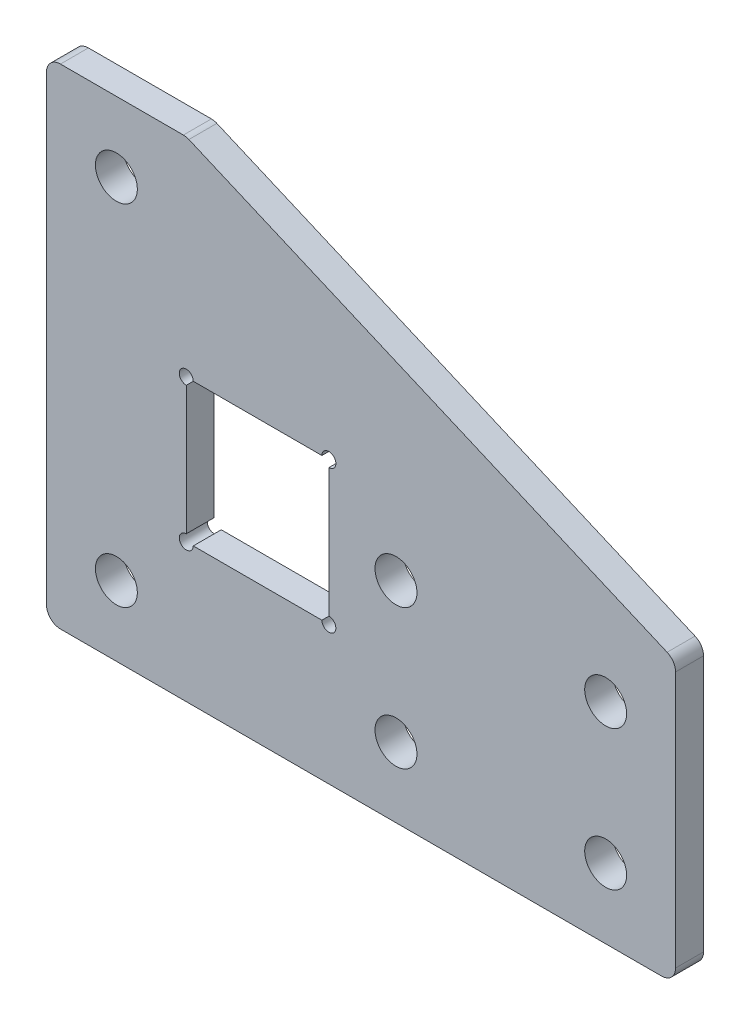
ISO-10303-21;
HEADER;
FILE_DESCRIPTION(('STEP AP214'),'2;1');
FILE_NAME('part.step','',(''),(''),'','','');
FILE_SCHEMA(('AUTOMOTIVE_DESIGN { 1 0 10303 214 1 1 1 1 }'));
ENDSEC;
DATA;
#1=APPLICATION_CONTEXT('core data for automotive mechanical design processes');
#2=APPLICATION_PROTOCOL_DEFINITION('international standard','automotive_design',2000,#1);
#3=PRODUCT_CONTEXT('',#1,'mechanical');
#4=PRODUCT('Part','Part','',(#3));
#5=PRODUCT_RELATED_PRODUCT_CATEGORY('part','',(#4));
#6=PRODUCT_DEFINITION_FORMATION('','',#4);
#7=PRODUCT_DEFINITION_CONTEXT('part definition',#1,'design');
#8=PRODUCT_DEFINITION('design','',#6,#7);
#9=PRODUCT_DEFINITION_SHAPE('','',#8);
#10=(LENGTH_UNIT() NAMED_UNIT(*) SI_UNIT(.MILLI.,.METRE.));
#11=(NAMED_UNIT(*) PLANE_ANGLE_UNIT() SI_UNIT($,.RADIAN.));
#12=(NAMED_UNIT(*) SI_UNIT($,.STERADIAN.) SOLID_ANGLE_UNIT());
#13=UNCERTAINTY_MEASURE_WITH_UNIT(LENGTH_MEASURE(1.E-05),#10,'distance_accuracy_value','');
#14=(GEOMETRIC_REPRESENTATION_CONTEXT(3) GLOBAL_UNCERTAINTY_ASSIGNED_CONTEXT((#13)) GLOBAL_UNIT_ASSIGNED_CONTEXT((#10,
#11,#12)) REPRESENTATION_CONTEXT('',''));
#15=CARTESIAN_POINT('',(0.,0.,0.));
#16=DIRECTION('',(0.,0.,1.));
#17=DIRECTION('',(1.,0.,0.));
#18=AXIS2_PLACEMENT_3D('',#15,#16,#17);
#19=CARTESIAN_POINT('',(0.,0.,2.));
#20=DIRECTION('',(0.,0.,-1.));
#21=DIRECTION('',(-1.,0.,0.));
#22=AXIS2_PLACEMENT_3D('',#19,#20,#21);
#23=PLANE('',#22);
#24=CARTESIAN_POINT('',(20.,10.,2.));
#25=DIRECTION('',(0.,0.,1.));
#26=DIRECTION('',(1.,0.,0.));
#27=AXIS2_PLACEMENT_3D('',#24,#25,#26);
#28=CIRCLE('',#27,1.50000000000003);
#29=CARTESIAN_POINT('',(21.5,10.,2.));
#30=VERTEX_POINT('',#29);
#31=EDGE_CURVE('E216',#30,#30,#28,.T.);
#32=ORIENTED_EDGE('',*,*,#31,.F.);
#33=EDGE_LOOP('',(#32));
#34=FACE_BOUND('',#33,.T.);
#35=CARTESIAN_POINT('',(35.,10.,2.));
#36=DIRECTION('',(0.,0.,1.));
#37=DIRECTION('',(1.,0.,0.));
#38=AXIS2_PLACEMENT_3D('',#35,#36,#37);
#39=CIRCLE('',#38,1.50000000000003);
#40=CARTESIAN_POINT('',(36.5,10.,2.));
#41=VERTEX_POINT('',#40);
#42=EDGE_CURVE('E222',#41,#41,#39,.T.);
#43=ORIENTED_EDGE('',*,*,#42,.F.);
#44=EDGE_LOOP('',(#43));
#45=FACE_BOUND('',#44,.T.);
#46=CARTESIAN_POINT('',(0.,25.,2.));
#47=DIRECTION('',(0.,0.,1.));
#48=DIRECTION('',(1.,0.,0.));
#49=AXIS2_PLACEMENT_3D('',#46,#47,#48);
#50=CIRCLE('',#49,1.50000000000003);
#51=CARTESIAN_POINT('',(1.50000000000003,25.,2.));
#52=VERTEX_POINT('',#51);
#53=EDGE_CURVE('E228',#52,#52,#50,.T.);
#54=ORIENTED_EDGE('',*,*,#53,.F.);
#55=EDGE_LOOP('',(#54));
#56=FACE_BOUND('',#55,.T.);
#57=CARTESIAN_POINT('',(20.,0.,2.));
#58=DIRECTION('',(0.,0.,1.));
#59=DIRECTION('',(1.,0.,0.));
#60=AXIS2_PLACEMENT_3D('',#57,#58,#59);
#61=CIRCLE('',#60,1.50000000000003);
#62=CARTESIAN_POINT('',(21.5,0.,2.));
#63=VERTEX_POINT('',#62);
#64=EDGE_CURVE('E234',#63,#63,#61,.T.);
#65=ORIENTED_EDGE('',*,*,#64,.F.);
#66=EDGE_LOOP('',(#65));
#67=FACE_BOUND('',#66,.T.);
#68=CARTESIAN_POINT('',(0.,0.,2.));
#69=DIRECTION('',(0.,0.,1.));
#70=DIRECTION('',(1.,0.,0.));
#71=AXIS2_PLACEMENT_3D('',#68,#69,#70);
#72=CIRCLE('',#71,1.50000000000002);
#73=CARTESIAN_POINT('',(1.50000000000002,0.,2.));
#74=VERTEX_POINT('',#73);
#75=EDGE_CURVE('E240',#74,#74,#72,.T.);
#76=ORIENTED_EDGE('',*,*,#75,.F.);
#77=EDGE_LOOP('',(#76));
#78=FACE_BOUND('',#77,.T.);
#79=CARTESIAN_POINT('',(35.,0.,2.));
#80=DIRECTION('',(0.,0.,1.));
#81=DIRECTION('',(1.,0.,0.));
#82=AXIS2_PLACEMENT_3D('',#79,#80,#81);
#83=CIRCLE('',#82,1.50000000000003);
#84=CARTESIAN_POINT('',(36.5,0.,2.));
#85=VERTEX_POINT('',#84);
#86=EDGE_CURVE('E246',#85,#85,#83,.T.);
#87=ORIENTED_EDGE('',*,*,#86,.F.);
#88=EDGE_LOOP('',(#87));
#89=FACE_BOUND('',#88,.T.);
#90=DIRECTION('',(1.,0.,0.));
#91=VECTOR('',#90,1.);
#92=CARTESIAN_POINT('',(40.,-5.,2.));
#93=LINE('',#92,#91);
#94=CARTESIAN_POINT('',(-3.99999999999998,-5.,2.));
#95=VERTEX_POINT('',#94);
#96=CARTESIAN_POINT('',(39.,-5.,2.));
#97=VERTEX_POINT('',#96);
#98=EDGE_CURVE('E255',#95,#97,#93,.T.);
#99=ORIENTED_EDGE('',*,*,#98,.T.);
#100=CARTESIAN_POINT('',(39.,-4.,2.));
#101=DIRECTION('',(0.,0.,-1.));
#102=DIRECTION('',(-1.,0.,0.));
#103=AXIS2_PLACEMENT_3D('',#100,#101,#102);
#104=CIRCLE('',#103,1.);
#105=CARTESIAN_POINT('',(40.,-4.,2.));
#106=VERTEX_POINT('',#105);
#107=EDGE_CURVE('E312',#97,#106,#104,.F.);
#108=ORIENTED_EDGE('',*,*,#107,.T.);
#109=DIRECTION('',(0.,1.,0.));
#110=VECTOR('',#109,1.);
#111=CARTESIAN_POINT('',(40.,15.,2.));
#112=LINE('',#111,#110);
#113=CARTESIAN_POINT('',(40.,14.3406038420194,2.));
#114=VERTEX_POINT('',#113);
#115=EDGE_CURVE('E259',#106,#114,#112,.T.);
#116=ORIENTED_EDGE('',*,*,#115,.T.);
#117=CARTESIAN_POINT('',(39.,14.3406038420194,2.));
#118=DIRECTION('',(0.,0.,-1.));
#119=DIRECTION('',(-1.,0.,0.));
#120=AXIS2_PLACEMENT_3D('',#117,#118,#119);
#121=CIRCLE('',#120,1.);
#122=CARTESIAN_POINT('',(39.3939192985792,15.2597488720375,2.));
#123=VERTEX_POINT('',#122);
#124=EDGE_CURVE('E306',#114,#123,#121,.F.);
#125=ORIENTED_EDGE('',*,*,#124,.T.);
#126=DIRECTION('',(-0.919145030018058,0.393919298579168,0.));
#127=VECTOR('',#126,1.);
#128=CARTESIAN_POINT('',(40.,15.,2.));
#129=LINE('',#128,#127);
#130=CARTESIAN_POINT('',(5.18866159662452,29.9191450300181,2.));
#131=VERTEX_POINT('',#130);
#132=EDGE_CURVE('E262',#123,#131,#129,.T.);
#133=ORIENTED_EDGE('',*,*,#132,.T.);
#134=CARTESIAN_POINT('',(4.79474229804536,29.,2.));
#135=DIRECTION('',(0.,0.,-1.));
#136=DIRECTION('',(-1.,0.,0.));
#137=AXIS2_PLACEMENT_3D('',#134,#135,#136);
#138=CIRCLE('',#137,1.);
#139=CARTESIAN_POINT('',(4.79474229804536,30.,2.));
#140=VERTEX_POINT('',#139);
#141=EDGE_CURVE('E61',#131,#140,#138,.F.);
#142=ORIENTED_EDGE('',*,*,#141,.T.);
#143=DIRECTION('',(-1.,0.,0.));
#144=VECTOR('',#143,1.);
#145=CARTESIAN_POINT('',(-5.,30.,2.));
#146=LINE('',#145,#144);
#147=CARTESIAN_POINT('',(-4.,30.,2.));
#148=VERTEX_POINT('',#147);
#149=EDGE_CURVE('E264',#140,#148,#146,.T.);
#150=ORIENTED_EDGE('',*,*,#149,.T.);
#151=CARTESIAN_POINT('',(-4.,29.,2.));
#152=DIRECTION('',(0.,0.,-1.));
#153=DIRECTION('',(-1.,0.,0.));
#154=AXIS2_PLACEMENT_3D('',#151,#152,#153);
#155=CIRCLE('',#154,1.);
#156=CARTESIAN_POINT('',(-5.,29.,2.));
#157=VERTEX_POINT('',#156);
#158=EDGE_CURVE('E308',#148,#157,#155,.F.);
#159=ORIENTED_EDGE('',*,*,#158,.T.);
#160=DIRECTION('',(0.,-1.,0.));
#161=VECTOR('',#160,1.);
#162=CARTESIAN_POINT('',(-5.,-5.,2.));
#163=LINE('',#162,#161);
#164=CARTESIAN_POINT('',(-5.,-4.,2.));
#165=VERTEX_POINT('',#164);
#166=EDGE_CURVE('E252',#157,#165,#163,.T.);
#167=ORIENTED_EDGE('',*,*,#166,.T.);
#168=CARTESIAN_POINT('',(-4.,-4.,2.));
#169=DIRECTION('',(0.,0.,-1.));
#170=DIRECTION('',(-1.,0.,0.));
#171=AXIS2_PLACEMENT_3D('',#168,#169,#170);
#172=CIRCLE('',#171,1.);
#173=EDGE_CURVE('E310',#165,#95,#172,.F.);
#174=ORIENTED_EDGE('',*,*,#173,.T.);
#175=EDGE_LOOP('',(#99,#108,#116,#125,#133,#142,#150,#159,#167,#174));
#176=FACE_BOUND('',#175,.T.);
#177=DIRECTION('',(0.,1.,0.));
#178=VECTOR('',#177,1.);
#179=CARTESIAN_POINT('',(15.2,15.1,2.));
#180=LINE('',#179,#178);
#181=CARTESIAN_POINT('',(15.2,5.4,2.));
#182=VERTEX_POINT('',#181);
#183=CARTESIAN_POINT('',(15.2,14.6,2.));
#184=VERTEX_POINT('',#183);
#185=EDGE_CURVE('E207',#182,#184,#180,.T.);
#186=ORIENTED_EDGE('',*,*,#185,.F.);
#187=CARTESIAN_POINT('',(15.2,4.9,2.));
#188=DIRECTION('',(0.,0.,1.));
#189=DIRECTION('',(1.,0.,0.));
#190=AXIS2_PLACEMENT_3D('',#187,#188,#189);
#191=CIRCLE('',#190,0.499999999999999);
#192=CARTESIAN_POINT('',(14.7,4.9,2.));
#193=VERTEX_POINT('',#192);
#194=EDGE_CURVE('E177',#193,#182,#191,.T.);
#195=ORIENTED_EDGE('',*,*,#194,.F.);
#196=DIRECTION('',(1.,0.,0.));
#197=VECTOR('',#196,1.);
#198=CARTESIAN_POINT('',(15.2,4.9,2.));
#199=LINE('',#198,#197);
#200=CARTESIAN_POINT('',(5.50000000000001,4.9,2.));
#201=VERTEX_POINT('',#200);
#202=EDGE_CURVE('E196',#201,#193,#199,.T.);
#203=ORIENTED_EDGE('',*,*,#202,.F.);
#204=CARTESIAN_POINT('',(5.00000000000001,4.9,2.));
#205=DIRECTION('',(0.,0.,1.));
#206=DIRECTION('',(1.,0.,0.));
#207=AXIS2_PLACEMENT_3D('',#204,#205,#206);
#208=CIRCLE('',#207,0.500000000000001);
#209=CARTESIAN_POINT('',(5.00000000000001,5.4,2.));
#210=VERTEX_POINT('',#209);
#211=EDGE_CURVE('E683',#210,#201,#208,.T.);
#212=ORIENTED_EDGE('',*,*,#211,.F.);
#213=DIRECTION('',(0.,-1.,0.));
#214=VECTOR('',#213,1.);
#215=CARTESIAN_POINT('',(5.00000000000001,4.9,2.));
#216=LINE('',#215,#214);
#217=CARTESIAN_POINT('',(5.00000000000001,14.6,2.));
#218=VERTEX_POINT('',#217);
#219=EDGE_CURVE('E192',#218,#210,#216,.T.);
#220=ORIENTED_EDGE('',*,*,#219,.F.);
#221=CARTESIAN_POINT('',(5.00000000000001,15.1,2.));
#222=DIRECTION('',(0.,0.,1.));
#223=DIRECTION('',(1.,0.,0.));
#224=AXIS2_PLACEMENT_3D('',#221,#222,#223);
#225=CIRCLE('',#224,0.500000000000002);
#226=CARTESIAN_POINT('',(5.50000000000001,15.1,2.));
#227=VERTEX_POINT('',#226);
#228=EDGE_CURVE('E191',#227,#218,#225,.T.);
#229=ORIENTED_EDGE('',*,*,#228,.F.);
#230=DIRECTION('',(-1.,0.,0.));
#231=VECTOR('',#230,1.);
#232=CARTESIAN_POINT('',(5.00000000000001,15.1,2.));
#233=LINE('',#232,#231);
#234=CARTESIAN_POINT('',(14.7,15.1,2.));
#235=VERTEX_POINT('',#234);
#236=EDGE_CURVE('E184',#235,#227,#233,.T.);
#237=ORIENTED_EDGE('',*,*,#236,.F.);
#238=CARTESIAN_POINT('',(15.2,15.1,2.));
#239=DIRECTION('',(0.,0.,1.));
#240=DIRECTION('',(1.,0.,0.));
#241=AXIS2_PLACEMENT_3D('',#238,#239,#240);
#242=CIRCLE('',#241,0.499999999999994);
#243=EDGE_CURVE('E165',#184,#235,#242,.T.);
#244=ORIENTED_EDGE('',*,*,#243,.F.);
#245=EDGE_LOOP('',(#186,#195,#203,#212,#220,#229,#237,#244));
#246=FACE_BOUND('',#245,.T.);
#247=ADVANCED_FACE('F39',(#34,#45,#56,#67,#78,#89,#176,#246),#23,.F.);
#248=CARTESIAN_POINT('',(0.,0.,0.));
#249=DIRECTION('',(0.,0.,-1.));
#250=DIRECTION('',(-1.,0.,0.));
#251=AXIS2_PLACEMENT_3D('',#248,#249,#250);
#252=PLANE('',#251);
#253=CARTESIAN_POINT('',(15.2,4.9,0.));
#254=DIRECTION('',(0.,0.,-1.));
#255=DIRECTION('',(-1.,0.,0.));
#256=AXIS2_PLACEMENT_3D('',#253,#254,#255);
#257=CIRCLE('',#256,0.499999999999999);
#258=CARTESIAN_POINT('',(15.2,5.4,0.));
#259=VERTEX_POINT('',#258);
#260=CARTESIAN_POINT('',(14.7,4.9,0.));
#261=VERTEX_POINT('',#260);
#262=EDGE_CURVE('E187',#259,#261,#257,.T.);
#263=ORIENTED_EDGE('',*,*,#262,.F.);
#264=DIRECTION('',(0.,1.,0.));
#265=VECTOR('',#264,1.);
#266=CARTESIAN_POINT('',(15.2,15.1,0.));
#267=LINE('',#266,#265);
#268=CARTESIAN_POINT('',(15.2,14.6,0.));
#269=VERTEX_POINT('',#268);
#270=EDGE_CURVE('E193',#259,#269,#267,.T.);
#271=ORIENTED_EDGE('',*,*,#270,.T.);
#272=CARTESIAN_POINT('',(15.2,15.1,0.));
#273=DIRECTION('',(0.,0.,-1.));
#274=DIRECTION('',(-1.,0.,0.));
#275=AXIS2_PLACEMENT_3D('',#272,#273,#274);
#276=CIRCLE('',#275,0.499999999999994);
#277=CARTESIAN_POINT('',(14.7,15.1,0.));
#278=VERTEX_POINT('',#277);
#279=EDGE_CURVE('E176',#278,#269,#276,.T.);
#280=ORIENTED_EDGE('',*,*,#279,.F.);
#281=DIRECTION('',(-1.,0.,0.));
#282=VECTOR('',#281,1.);
#283=CARTESIAN_POINT('',(5.00000000000001,15.1,0.));
#284=LINE('',#283,#282);
#285=CARTESIAN_POINT('',(5.50000000000001,15.1,0.));
#286=VERTEX_POINT('',#285);
#287=EDGE_CURVE('E186',#278,#286,#284,.T.);
#288=ORIENTED_EDGE('',*,*,#287,.T.);
#289=CARTESIAN_POINT('',(5.00000000000001,15.1,0.));
#290=DIRECTION('',(0.,0.,-1.));
#291=DIRECTION('',(-1.,0.,0.));
#292=AXIS2_PLACEMENT_3D('',#289,#290,#291);
#293=CIRCLE('',#292,0.500000000000002);
#294=CARTESIAN_POINT('',(5.00000000000001,14.6,0.));
#295=VERTEX_POINT('',#294);
#296=EDGE_CURVE('E697',#295,#286,#293,.T.);
#297=ORIENTED_EDGE('',*,*,#296,.F.);
#298=DIRECTION('',(0.,-1.,0.));
#299=VECTOR('',#298,1.);
#300=CARTESIAN_POINT('',(5.00000000000001,4.9,0.));
#301=LINE('',#300,#299);
#302=CARTESIAN_POINT('',(5.00000000000001,5.4,0.));
#303=VERTEX_POINT('',#302);
#304=EDGE_CURVE('E211',#295,#303,#301,.T.);
#305=ORIENTED_EDGE('',*,*,#304,.T.);
#306=CARTESIAN_POINT('',(5.00000000000001,4.9,0.));
#307=DIRECTION('',(0.,0.,-1.));
#308=DIRECTION('',(-1.,0.,0.));
#309=AXIS2_PLACEMENT_3D('',#306,#307,#308);
#310=CIRCLE('',#309,0.500000000000001);
#311=CARTESIAN_POINT('',(5.50000000000001,4.9,0.));
#312=VERTEX_POINT('',#311);
#313=EDGE_CURVE('E694',#312,#303,#310,.T.);
#314=ORIENTED_EDGE('',*,*,#313,.F.);
#315=DIRECTION('',(1.,0.,0.));
#316=VECTOR('',#315,1.);
#317=CARTESIAN_POINT('',(15.2,4.9,0.));
#318=LINE('',#317,#316);
#319=EDGE_CURVE('E199',#312,#261,#318,.T.);
#320=ORIENTED_EDGE('',*,*,#319,.T.);
#321=EDGE_LOOP('',(#263,#271,#280,#288,#297,#305,#314,#320));
#322=FACE_BOUND('',#321,.T.);
#323=CARTESIAN_POINT('',(35.,10.,0.));
#324=DIRECTION('',(0.,0.,1.));
#325=DIRECTION('',(1.,0.,0.));
#326=AXIS2_PLACEMENT_3D('',#323,#324,#325);
#327=CIRCLE('',#326,1.50000000000003);
#328=CARTESIAN_POINT('',(36.5,10.,0.));
#329=VERTEX_POINT('',#328);
#330=EDGE_CURVE('E219',#329,#329,#327,.T.);
#331=ORIENTED_EDGE('',*,*,#330,.T.);
#332=EDGE_LOOP('',(#331));
#333=FACE_BOUND('',#332,.T.);
#334=CARTESIAN_POINT('',(20.,0.,0.));
#335=DIRECTION('',(0.,0.,1.));
#336=DIRECTION('',(1.,0.,0.));
#337=AXIS2_PLACEMENT_3D('',#334,#335,#336);
#338=CIRCLE('',#337,1.50000000000003);
#339=CARTESIAN_POINT('',(21.5,0.,0.));
#340=VERTEX_POINT('',#339);
#341=EDGE_CURVE('E231',#340,#340,#338,.T.);
#342=ORIENTED_EDGE('',*,*,#341,.T.);
#343=EDGE_LOOP('',(#342));
#344=FACE_BOUND('',#343,.T.);
#345=CARTESIAN_POINT('',(35.,0.,0.));
#346=DIRECTION('',(0.,0.,1.));
#347=DIRECTION('',(1.,0.,0.));
#348=AXIS2_PLACEMENT_3D('',#345,#346,#347);
#349=CIRCLE('',#348,1.50000000000003);
#350=CARTESIAN_POINT('',(36.5,0.,0.));
#351=VERTEX_POINT('',#350);
#352=EDGE_CURVE('E243',#351,#351,#349,.T.);
#353=ORIENTED_EDGE('',*,*,#352,.T.);
#354=EDGE_LOOP('',(#353));
#355=FACE_BOUND('',#354,.T.);
#356=DIRECTION('',(0.,1.,0.));
#357=VECTOR('',#356,1.);
#358=CARTESIAN_POINT('',(40.,15.,0.));
#359=LINE('',#358,#357);
#360=CARTESIAN_POINT('',(40.,-4.,0.));
#361=VERTEX_POINT('',#360);
#362=CARTESIAN_POINT('',(40.,14.3406038420194,0.));
#363=VERTEX_POINT('',#362);
#364=EDGE_CURVE('E271',#361,#363,#359,.T.);
#365=ORIENTED_EDGE('',*,*,#364,.F.);
#366=CARTESIAN_POINT('',(39.,-4.,0.));
#367=DIRECTION('',(0.,0.,-1.));
#368=DIRECTION('',(-1.,0.,0.));
#369=AXIS2_PLACEMENT_3D('',#366,#367,#368);
#370=CIRCLE('',#369,1.);
#371=CARTESIAN_POINT('',(39.,-5.,0.));
#372=VERTEX_POINT('',#371);
#373=EDGE_CURVE('E298',#361,#372,#370,.T.);
#374=ORIENTED_EDGE('',*,*,#373,.T.);
#375=DIRECTION('',(1.,0.,0.));
#376=VECTOR('',#375,1.);
#377=CARTESIAN_POINT('',(40.,-5.,0.));
#378=LINE('',#377,#376);
#379=CARTESIAN_POINT('',(-3.99999999999998,-5.,0.));
#380=VERTEX_POINT('',#379);
#381=EDGE_CURVE('E268',#380,#372,#378,.T.);
#382=ORIENTED_EDGE('',*,*,#381,.F.);
#383=CARTESIAN_POINT('',(-4.,-4.,0.));
#384=DIRECTION('',(0.,0.,-1.));
#385=DIRECTION('',(-1.,0.,0.));
#386=AXIS2_PLACEMENT_3D('',#383,#384,#385);
#387=CIRCLE('',#386,1.);
#388=CARTESIAN_POINT('',(-5.,-4.,0.));
#389=VERTEX_POINT('',#388);
#390=EDGE_CURVE('E296',#380,#389,#387,.T.);
#391=ORIENTED_EDGE('',*,*,#390,.T.);
#392=DIRECTION('',(0.,-1.,0.));
#393=VECTOR('',#392,1.);
#394=CARTESIAN_POINT('',(-5.,-5.,0.));
#395=LINE('',#394,#393);
#396=CARTESIAN_POINT('',(-5.,29.,0.));
#397=VERTEX_POINT('',#396);
#398=EDGE_CURVE('E249',#397,#389,#395,.T.);
#399=ORIENTED_EDGE('',*,*,#398,.F.);
#400=CARTESIAN_POINT('',(-4.,29.,0.));
#401=DIRECTION('',(0.,0.,-1.));
#402=DIRECTION('',(-1.,0.,0.));
#403=AXIS2_PLACEMENT_3D('',#400,#401,#402);
#404=CIRCLE('',#403,1.);
#405=CARTESIAN_POINT('',(-4.,30.,0.));
#406=VERTEX_POINT('',#405);
#407=EDGE_CURVE('E294',#397,#406,#404,.T.);
#408=ORIENTED_EDGE('',*,*,#407,.T.);
#409=DIRECTION('',(-1.,0.,0.));
#410=VECTOR('',#409,1.);
#411=CARTESIAN_POINT('',(-5.,30.,0.));
#412=LINE('',#411,#410);
#413=CARTESIAN_POINT('',(4.79474229804536,30.,0.));
#414=VERTEX_POINT('',#413);
#415=EDGE_CURVE('E256',#414,#406,#412,.T.);
#416=ORIENTED_EDGE('',*,*,#415,.F.);
#417=CARTESIAN_POINT('',(4.79474229804536,29.,0.));
#418=DIRECTION('',(0.,0.,-1.));
#419=DIRECTION('',(-1.,0.,0.));
#420=AXIS2_PLACEMENT_3D('',#417,#418,#419);
#421=CIRCLE('',#420,1.);
#422=CARTESIAN_POINT('',(5.18866159662452,29.9191450300181,0.));
#423=VERTEX_POINT('',#422);
#424=EDGE_CURVE('E290',#414,#423,#421,.T.);
#425=ORIENTED_EDGE('',*,*,#424,.T.);
#426=DIRECTION('',(-0.919145030018058,0.393919298579168,0.));
#427=VECTOR('',#426,1.);
#428=CARTESIAN_POINT('',(40.,15.,0.));
#429=LINE('',#428,#427);
#430=CARTESIAN_POINT('',(39.3939192985792,15.2597488720375,0.));
#431=VERTEX_POINT('',#430);
#432=EDGE_CURVE('E274',#431,#423,#429,.T.);
#433=ORIENTED_EDGE('',*,*,#432,.F.);
#434=CARTESIAN_POINT('',(39.,14.3406038420194,0.));
#435=DIRECTION('',(0.,0.,-1.));
#436=DIRECTION('',(-1.,0.,0.));
#437=AXIS2_PLACEMENT_3D('',#434,#435,#436);
#438=CIRCLE('',#437,1.);
#439=EDGE_CURVE('E292',#431,#363,#438,.T.);
#440=ORIENTED_EDGE('',*,*,#439,.T.);
#441=EDGE_LOOP('',(#365,#374,#382,#391,#399,#408,#416,#425,#433,#440));
#442=FACE_BOUND('',#441,.T.);
#443=CARTESIAN_POINT('',(0.,0.,0.));
#444=DIRECTION('',(0.,0.,1.));
#445=DIRECTION('',(1.,0.,0.));
#446=AXIS2_PLACEMENT_3D('',#443,#444,#445);
#447=CIRCLE('',#446,1.50000000000002);
#448=CARTESIAN_POINT('',(1.50000000000002,0.,0.));
#449=VERTEX_POINT('',#448);
#450=EDGE_CURVE('E237',#449,#449,#447,.T.);
#451=ORIENTED_EDGE('',*,*,#450,.T.);
#452=EDGE_LOOP('',(#451));
#453=FACE_BOUND('',#452,.T.);
#454=CARTESIAN_POINT('',(0.,25.,0.));
#455=DIRECTION('',(0.,0.,1.));
#456=DIRECTION('',(1.,0.,0.));
#457=AXIS2_PLACEMENT_3D('',#454,#455,#456);
#458=CIRCLE('',#457,1.50000000000003);
#459=CARTESIAN_POINT('',(1.50000000000003,25.,0.));
#460=VERTEX_POINT('',#459);
#461=EDGE_CURVE('E225',#460,#460,#458,.T.);
#462=ORIENTED_EDGE('',*,*,#461,.T.);
#463=EDGE_LOOP('',(#462));
#464=FACE_BOUND('',#463,.T.);
#465=CARTESIAN_POINT('',(20.,10.,0.));
#466=DIRECTION('',(0.,0.,1.));
#467=DIRECTION('',(1.,0.,0.));
#468=AXIS2_PLACEMENT_3D('',#465,#466,#467);
#469=CIRCLE('',#468,1.50000000000003);
#470=CARTESIAN_POINT('',(21.5,10.,0.));
#471=VERTEX_POINT('',#470);
#472=EDGE_CURVE('E209',#471,#471,#469,.T.);
#473=ORIENTED_EDGE('',*,*,#472,.T.);
#474=EDGE_LOOP('',(#473));
#475=FACE_BOUND('',#474,.T.);
#476=ADVANCED_FACE('F335',(#322,#333,#344,#355,#442,#453,#464,#475),#252,.T.);
#477=CARTESIAN_POINT('',(-5.,-5.,2.));
#478=DIRECTION('',(1.,0.,0.));
#479=DIRECTION('',(0.,1.,0.));
#480=AXIS2_PLACEMENT_3D('',#477,#478,#479);
#481=PLANE('',#480);
#482=ORIENTED_EDGE('',*,*,#398,.T.);
#483=DIRECTION('',(0.,0.,-1.));
#484=VECTOR('',#483,1.);
#485=CARTESIAN_POINT('',(-5.,-4.,2.));
#486=LINE('',#485,#484);
#487=EDGE_CURVE('E317',#389,#165,#486,.F.);
#488=ORIENTED_EDGE('',*,*,#487,.T.);
#489=ORIENTED_EDGE('',*,*,#166,.F.);
#490=DIRECTION('',(0.,0.,-1.));
#491=VECTOR('',#490,1.);
#492=CARTESIAN_POINT('',(-5.,29.,2.));
#493=LINE('',#492,#491);
#494=EDGE_CURVE('E314',#157,#397,#493,.T.);
#495=ORIENTED_EDGE('',*,*,#494,.T.);
#496=EDGE_LOOP('',(#482,#488,#489,#495));
#497=FACE_BOUND('',#496,.T.);
#498=ADVANCED_FACE('F344',(#497),#481,.F.);
#499=CARTESIAN_POINT('',(40.,-5.,2.));
#500=DIRECTION('',(0.,1.,0.));
#501=DIRECTION('',(-1.,0.,0.));
#502=AXIS2_PLACEMENT_3D('',#499,#500,#501);
#503=PLANE('',#502);
#504=ORIENTED_EDGE('',*,*,#381,.T.);
#505=DIRECTION('',(0.,0.,-1.));
#506=VECTOR('',#505,1.);
#507=CARTESIAN_POINT('',(39.,-5.,2.));
#508=LINE('',#507,#506);
#509=EDGE_CURVE('E303',#372,#97,#508,.F.);
#510=ORIENTED_EDGE('',*,*,#509,.T.);
#511=ORIENTED_EDGE('',*,*,#98,.F.);
#512=DIRECTION('',(0.,0.,-1.));
#513=VECTOR('',#512,1.);
#514=CARTESIAN_POINT('',(-4.,-5.,2.));
#515=LINE('',#514,#513);
#516=EDGE_CURVE('E300',#95,#380,#515,.T.);
#517=ORIENTED_EDGE('',*,*,#516,.T.);
#518=EDGE_LOOP('',(#504,#510,#511,#517));
#519=FACE_BOUND('',#518,.T.);
#520=ADVANCED_FACE('F353',(#519),#503,.F.);
#521=CARTESIAN_POINT('',(40.,15.,2.));
#522=DIRECTION('',(-1.,0.,0.));
#523=DIRECTION('',(0.,0.,1.));
#524=AXIS2_PLACEMENT_3D('',#521,#522,#523);
#525=PLANE('',#524);
#526=ORIENTED_EDGE('',*,*,#115,.F.);
#527=DIRECTION('',(0.,0.,-1.));
#528=VECTOR('',#527,1.);
#529=CARTESIAN_POINT('',(40.,-4.,2.));
#530=LINE('',#529,#528);
#531=EDGE_CURVE('E287',#106,#361,#530,.T.);
#532=ORIENTED_EDGE('',*,*,#531,.T.);
#533=ORIENTED_EDGE('',*,*,#364,.T.);
#534=DIRECTION('',(0.,0.,-1.));
#535=VECTOR('',#534,1.);
#536=CARTESIAN_POINT('',(40.,14.3406038420194,2.));
#537=LINE('',#536,#535);
#538=EDGE_CURVE('E285',#363,#114,#537,.F.);
#539=ORIENTED_EDGE('',*,*,#538,.T.);
#540=EDGE_LOOP('',(#526,#532,#533,#539));
#541=FACE_BOUND('',#540,.T.);
#542=ADVANCED_FACE('F361',(#541),#525,.F.);
#543=CARTESIAN_POINT('',(40.,15.,2.));
#544=DIRECTION('',(-0.393919298579168,-0.919145030018058,0.));
#545=DIRECTION('',(0.919145030018058,-0.393919298579168,0.));
#546=AXIS2_PLACEMENT_3D('',#543,#544,#545);
#547=PLANE('',#546);
#548=ORIENTED_EDGE('',*,*,#132,.F.);
#549=DIRECTION('',(0.,0.,-1.));
#550=VECTOR('',#549,1.);
#551=CARTESIAN_POINT('',(39.3939192985792,15.2597488720375,2.));
#552=LINE('',#551,#550);
#553=EDGE_CURVE('E11',#123,#431,#552,.T.);
#554=ORIENTED_EDGE('',*,*,#553,.T.);
#555=ORIENTED_EDGE('',*,*,#432,.T.);
#556=DIRECTION('',(0.,0.,-1.));
#557=VECTOR('',#556,1.);
#558=CARTESIAN_POINT('',(5.18866159662452,29.9191450300181,2.));
#559=LINE('',#558,#557);
#560=EDGE_CURVE('E47',#423,#131,#559,.F.);
#561=ORIENTED_EDGE('',*,*,#560,.T.);
#562=EDGE_LOOP('',(#548,#554,#555,#561));
#563=FACE_BOUND('',#562,.T.);
#564=ADVANCED_FACE('F325',(#563),#547,.F.);
#565=CARTESIAN_POINT('',(-5.,30.,2.));
#566=DIRECTION('',(0.,-1.,0.));
#567=DIRECTION('',(0.,0.,-1.));
#568=AXIS2_PLACEMENT_3D('',#565,#566,#567);
#569=PLANE('',#568);
#570=ORIENTED_EDGE('',*,*,#415,.T.);
#571=DIRECTION('',(0.,0.,-1.));
#572=VECTOR('',#571,1.);
#573=CARTESIAN_POINT('',(-4.,30.,2.));
#574=LINE('',#573,#572);
#575=EDGE_CURVE('E54',#406,#148,#574,.F.);
#576=ORIENTED_EDGE('',*,*,#575,.T.);
#577=ORIENTED_EDGE('',*,*,#149,.F.);
#578=DIRECTION('',(0.,0.,-1.));
#579=VECTOR('',#578,1.);
#580=CARTESIAN_POINT('',(4.79474229804536,30.,2.));
#581=LINE('',#580,#579);
#582=EDGE_CURVE('E319',#140,#414,#581,.T.);
#583=ORIENTED_EDGE('',*,*,#582,.T.);
#584=EDGE_LOOP('',(#570,#576,#577,#583));
#585=FACE_BOUND('',#584,.T.);
#586=ADVANCED_FACE('F332',(#585),#569,.F.);
#587=CARTESIAN_POINT('',(35.,0.,2.));
#588=DIRECTION('',(0.,0.,-1.));
#589=DIRECTION('',(-1.,0.,0.));
#590=AXIS2_PLACEMENT_3D('',#587,#588,#589);
#591=CYLINDRICAL_SURFACE('',#590,1.50000000000003);
#592=ORIENTED_EDGE('',*,*,#86,.T.);
#593=EDGE_LOOP('',(#592));
#594=FACE_BOUND('',#593,.T.);
#595=ORIENTED_EDGE('',*,*,#352,.F.);
#596=EDGE_LOOP('',(#595));
#597=FACE_BOUND('',#596,.T.);
#598=ADVANCED_FACE('F382',(#594,#597),#591,.F.);
#599=CARTESIAN_POINT('',(0.,0.,2.));
#600=DIRECTION('',(0.,0.,-1.));
#601=DIRECTION('',(-1.,0.,0.));
#602=AXIS2_PLACEMENT_3D('',#599,#600,#601);
#603=CYLINDRICAL_SURFACE('',#602,1.50000000000002);
#604=ORIENTED_EDGE('',*,*,#75,.T.);
#605=EDGE_LOOP('',(#604));
#606=FACE_BOUND('',#605,.T.);
#607=ORIENTED_EDGE('',*,*,#450,.F.);
#608=EDGE_LOOP('',(#607));
#609=FACE_BOUND('',#608,.T.);
#610=ADVANCED_FACE('F547',(#606,#609),#603,.F.);
#611=CARTESIAN_POINT('',(20.,0.,2.));
#612=DIRECTION('',(0.,0.,-1.));
#613=DIRECTION('',(-1.,0.,0.));
#614=AXIS2_PLACEMENT_3D('',#611,#612,#613);
#615=CYLINDRICAL_SURFACE('',#614,1.50000000000003);
#616=ORIENTED_EDGE('',*,*,#64,.T.);
#617=EDGE_LOOP('',(#616));
#618=FACE_BOUND('',#617,.T.);
#619=ORIENTED_EDGE('',*,*,#341,.F.);
#620=EDGE_LOOP('',(#619));
#621=FACE_BOUND('',#620,.T.);
#622=ADVANCED_FACE('F537',(#618,#621),#615,.F.);
#623=CARTESIAN_POINT('',(0.,25.,2.));
#624=DIRECTION('',(0.,0.,-1.));
#625=DIRECTION('',(-1.,0.,0.));
#626=AXIS2_PLACEMENT_3D('',#623,#624,#625);
#627=CYLINDRICAL_SURFACE('',#626,1.50000000000003);
#628=ORIENTED_EDGE('',*,*,#53,.T.);
#629=EDGE_LOOP('',(#628));
#630=FACE_BOUND('',#629,.T.);
#631=ORIENTED_EDGE('',*,*,#461,.F.);
#632=EDGE_LOOP('',(#631));
#633=FACE_BOUND('',#632,.T.);
#634=ADVANCED_FACE('F527',(#630,#633),#627,.F.);
#635=CARTESIAN_POINT('',(35.,10.,2.));
#636=DIRECTION('',(0.,0.,-1.));
#637=DIRECTION('',(-1.,0.,0.));
#638=AXIS2_PLACEMENT_3D('',#635,#636,#637);
#639=CYLINDRICAL_SURFACE('',#638,1.50000000000003);
#640=ORIENTED_EDGE('',*,*,#42,.T.);
#641=EDGE_LOOP('',(#640));
#642=FACE_BOUND('',#641,.T.);
#643=ORIENTED_EDGE('',*,*,#330,.F.);
#644=EDGE_LOOP('',(#643));
#645=FACE_BOUND('',#644,.T.);
#646=ADVANCED_FACE('F517',(#642,#645),#639,.F.);
#647=CARTESIAN_POINT('',(20.,10.,2.));
#648=DIRECTION('',(0.,0.,-1.));
#649=DIRECTION('',(-1.,0.,0.));
#650=AXIS2_PLACEMENT_3D('',#647,#648,#649);
#651=CYLINDRICAL_SURFACE('',#650,1.50000000000003);
#652=ORIENTED_EDGE('',*,*,#31,.T.);
#653=EDGE_LOOP('',(#652));
#654=FACE_BOUND('',#653,.T.);
#655=ORIENTED_EDGE('',*,*,#472,.F.);
#656=EDGE_LOOP('',(#655));
#657=FACE_BOUND('',#656,.T.);
#658=ADVANCED_FACE('F508',(#654,#657),#651,.F.);
#659=CARTESIAN_POINT('',(5.00000000000001,15.1,2.));
#660=DIRECTION('',(0.,-1.,0.));
#661=DIRECTION('',(1.,0.,0.));
#662=AXIS2_PLACEMENT_3D('',#659,#660,#661);
#663=PLANE('',#662);
#664=DIRECTION('',(0.,0.,1.));
#665=VECTOR('',#664,1.);
#666=CARTESIAN_POINT('',(5.50000000000001,15.1,-8.));
#667=LINE('',#666,#665);
#668=EDGE_CURVE('E202',#286,#227,#667,.T.);
#669=ORIENTED_EDGE('',*,*,#668,.F.);
#670=ORIENTED_EDGE('',*,*,#287,.F.);
#671=DIRECTION('',(0.,0.,1.));
#672=VECTOR('',#671,1.);
#673=CARTESIAN_POINT('',(14.7,15.1,-8.));
#674=LINE('',#673,#672);
#675=EDGE_CURVE('E168',#235,#278,#674,.F.);
#676=ORIENTED_EDGE('',*,*,#675,.F.);
#677=ORIENTED_EDGE('',*,*,#236,.T.);
#678=EDGE_LOOP('',(#669,#670,#676,#677));
#679=FACE_BOUND('',#678,.T.);
#680=ADVANCED_FACE('F183',(#679),#663,.T.);
#681=CARTESIAN_POINT('',(5.00000000000001,4.9,2.));
#682=DIRECTION('',(1.,0.,0.));
#683=DIRECTION('',(0.,1.,0.));
#684=AXIS2_PLACEMENT_3D('',#681,#682,#683);
#685=PLANE('',#684);
#686=DIRECTION('',(0.,0.,1.));
#687=VECTOR('',#686,1.);
#688=CARTESIAN_POINT('',(5.00000000000001,14.6,-8.));
#689=LINE('',#688,#687);
#690=EDGE_CURVE('E283',#218,#295,#689,.F.);
#691=ORIENTED_EDGE('',*,*,#690,.F.);
#692=ORIENTED_EDGE('',*,*,#219,.T.);
#693=DIRECTION('',(0.,0.,1.));
#694=VECTOR('',#693,1.);
#695=CARTESIAN_POINT('',(5.00000000000001,5.4,-8.));
#696=LINE('',#695,#694);
#697=EDGE_CURVE('E696',#303,#210,#696,.T.);
#698=ORIENTED_EDGE('',*,*,#697,.F.);
#699=ORIENTED_EDGE('',*,*,#304,.F.);
#700=EDGE_LOOP('',(#691,#692,#698,#699));
#701=FACE_BOUND('',#700,.T.);
#702=ADVANCED_FACE('F489',(#701),#685,.T.);
#703=CARTESIAN_POINT('',(15.2,4.9,2.));
#704=DIRECTION('',(0.,1.,0.));
#705=DIRECTION('',(0.,0.,1.));
#706=AXIS2_PLACEMENT_3D('',#703,#704,#705);
#707=PLANE('',#706);
#708=DIRECTION('',(0.,0.,1.));
#709=VECTOR('',#708,1.);
#710=CARTESIAN_POINT('',(14.7,4.9,-8.));
#711=LINE('',#710,#709);
#712=EDGE_CURVE('E692',#261,#193,#711,.T.);
#713=ORIENTED_EDGE('',*,*,#712,.F.);
#714=ORIENTED_EDGE('',*,*,#319,.F.);
#715=DIRECTION('',(0.,0.,1.));
#716=VECTOR('',#715,1.);
#717=CARTESIAN_POINT('',(5.50000000000001,4.9,-8.));
#718=LINE('',#717,#716);
#719=EDGE_CURVE('E281',#201,#312,#718,.F.);
#720=ORIENTED_EDGE('',*,*,#719,.F.);
#721=ORIENTED_EDGE('',*,*,#202,.T.);
#722=EDGE_LOOP('',(#713,#714,#720,#721));
#723=FACE_BOUND('',#722,.T.);
#724=ADVANCED_FACE('F479',(#723),#707,.T.);
#725=CARTESIAN_POINT('',(15.2,15.1,2.));
#726=DIRECTION('',(-1.,0.,0.));
#727=DIRECTION('',(0.,-1.,0.));
#728=AXIS2_PLACEMENT_3D('',#725,#726,#727);
#729=PLANE('',#728);
#730=DIRECTION('',(0.,0.,1.));
#731=VECTOR('',#730,1.);
#732=CARTESIAN_POINT('',(15.2,5.4,-8.));
#733=LINE('',#732,#731);
#734=EDGE_CURVE('E279',#182,#259,#733,.F.);
#735=ORIENTED_EDGE('',*,*,#734,.F.);
#736=ORIENTED_EDGE('',*,*,#185,.T.);
#737=DIRECTION('',(0.,0.,1.));
#738=VECTOR('',#737,1.);
#739=CARTESIAN_POINT('',(15.2,14.6,-8.));
#740=LINE('',#739,#738);
#741=EDGE_CURVE('E171',#269,#184,#740,.T.);
#742=ORIENTED_EDGE('',*,*,#741,.F.);
#743=ORIENTED_EDGE('',*,*,#270,.F.);
#744=EDGE_LOOP('',(#735,#736,#742,#743));
#745=FACE_BOUND('',#744,.T.);
#746=ADVANCED_FACE('F470',(#745),#729,.T.);
#747=CARTESIAN_POINT('',(15.2,15.1,-8.));
#748=DIRECTION('',(0.,0.,1.));
#749=DIRECTION('',(1.,0.,0.));
#750=AXIS2_PLACEMENT_3D('',#747,#748,#749);
#751=CYLINDRICAL_SURFACE('',#750,0.499999999999994);
#752=ORIENTED_EDGE('',*,*,#675,.T.);
#753=ORIENTED_EDGE('',*,*,#279,.T.);
#754=ORIENTED_EDGE('',*,*,#741,.T.);
#755=ORIENTED_EDGE('',*,*,#243,.T.);
#756=EDGE_LOOP('',(#752,#753,#754,#755));
#757=FACE_BOUND('',#756,.T.);
#758=ADVANCED_FACE('F167',(#757),#751,.F.);
#759=CARTESIAN_POINT('',(15.2,4.9,-8.));
#760=DIRECTION('',(0.,0.,1.));
#761=DIRECTION('',(1.,0.,0.));
#762=AXIS2_PLACEMENT_3D('',#759,#760,#761);
#763=CYLINDRICAL_SURFACE('',#762,0.499999999999999);
#764=ORIENTED_EDGE('',*,*,#712,.T.);
#765=ORIENTED_EDGE('',*,*,#194,.T.);
#766=ORIENTED_EDGE('',*,*,#734,.T.);
#767=ORIENTED_EDGE('',*,*,#262,.T.);
#768=EDGE_LOOP('',(#764,#765,#766,#767));
#769=FACE_BOUND('',#768,.T.);
#770=ADVANCED_FACE('F451',(#769),#763,.F.);
#771=CARTESIAN_POINT('',(5.00000000000001,4.9,-8.));
#772=DIRECTION('',(0.,0.,1.));
#773=DIRECTION('',(1.,0.,0.));
#774=AXIS2_PLACEMENT_3D('',#771,#772,#773);
#775=CYLINDRICAL_SURFACE('',#774,0.500000000000001);
#776=ORIENTED_EDGE('',*,*,#697,.T.);
#777=ORIENTED_EDGE('',*,*,#211,.T.);
#778=ORIENTED_EDGE('',*,*,#719,.T.);
#779=ORIENTED_EDGE('',*,*,#313,.T.);
#780=EDGE_LOOP('',(#776,#777,#778,#779));
#781=FACE_BOUND('',#780,.T.);
#782=ADVANCED_FACE('F441',(#781),#775,.F.);
#783=CARTESIAN_POINT('',(5.00000000000001,15.1,-8.));
#784=DIRECTION('',(0.,0.,1.));
#785=DIRECTION('',(1.,0.,0.));
#786=AXIS2_PLACEMENT_3D('',#783,#784,#785);
#787=CYLINDRICAL_SURFACE('',#786,0.500000000000002);
#788=ORIENTED_EDGE('',*,*,#668,.T.);
#789=ORIENTED_EDGE('',*,*,#228,.T.);
#790=ORIENTED_EDGE('',*,*,#690,.T.);
#791=ORIENTED_EDGE('',*,*,#296,.T.);
#792=EDGE_LOOP('',(#788,#789,#790,#791));
#793=FACE_BOUND('',#792,.T.);
#794=ADVANCED_FACE('F397',(#793),#787,.F.);
#795=CARTESIAN_POINT('',(39.,-4.,2.));
#796=DIRECTION('',(0.,0.,-1.));
#797=DIRECTION('',(-1.,0.,0.));
#798=AXIS2_PLACEMENT_3D('',#795,#796,#797);
#799=CYLINDRICAL_SURFACE('',#798,1.);
#800=ORIENTED_EDGE('',*,*,#107,.F.);
#801=ORIENTED_EDGE('',*,*,#509,.F.);
#802=ORIENTED_EDGE('',*,*,#373,.F.);
#803=ORIENTED_EDGE('',*,*,#531,.F.);
#804=EDGE_LOOP('',(#800,#801,#802,#803));
#805=FACE_BOUND('',#804,.T.);
#806=ADVANCED_FACE('F358',(#805),#799,.T.);
#807=CARTESIAN_POINT('',(-4.,-4.,2.));
#808=DIRECTION('',(0.,0.,-1.));
#809=DIRECTION('',(-1.,0.,0.));
#810=AXIS2_PLACEMENT_3D('',#807,#808,#809);
#811=CYLINDRICAL_SURFACE('',#810,1.);
#812=ORIENTED_EDGE('',*,*,#173,.F.);
#813=ORIENTED_EDGE('',*,*,#487,.F.);
#814=ORIENTED_EDGE('',*,*,#390,.F.);
#815=ORIENTED_EDGE('',*,*,#516,.F.);
#816=EDGE_LOOP('',(#812,#813,#814,#815));
#817=FACE_BOUND('',#816,.T.);
#818=ADVANCED_FACE('F350',(#817),#811,.T.);
#819=CARTESIAN_POINT('',(-4.,29.,2.));
#820=DIRECTION('',(0.,0.,-1.));
#821=DIRECTION('',(-1.,0.,0.));
#822=AXIS2_PLACEMENT_3D('',#819,#820,#821);
#823=CYLINDRICAL_SURFACE('',#822,1.);
#824=ORIENTED_EDGE('',*,*,#158,.F.);
#825=ORIENTED_EDGE('',*,*,#575,.F.);
#826=ORIENTED_EDGE('',*,*,#407,.F.);
#827=ORIENTED_EDGE('',*,*,#494,.F.);
#828=EDGE_LOOP('',(#824,#825,#826,#827));
#829=FACE_BOUND('',#828,.T.);
#830=ADVANCED_FACE('F341',(#829),#823,.T.);
#831=CARTESIAN_POINT('',(39.,14.3406038420194,2.));
#832=DIRECTION('',(0.,0.,-1.));
#833=DIRECTION('',(-1.,0.,0.));
#834=AXIS2_PLACEMENT_3D('',#831,#832,#833);
#835=CYLINDRICAL_SURFACE('',#834,1.);
#836=ORIENTED_EDGE('',*,*,#124,.F.);
#837=ORIENTED_EDGE('',*,*,#538,.F.);
#838=ORIENTED_EDGE('',*,*,#439,.F.);
#839=ORIENTED_EDGE('',*,*,#553,.F.);
#840=EDGE_LOOP('',(#836,#837,#838,#839));
#841=FACE_BOUND('',#840,.T.);
#842=ADVANCED_FACE('F364',(#841),#835,.T.);
#843=CARTESIAN_POINT('',(4.79474229804536,29.,2.));
#844=DIRECTION('',(0.,0.,-1.));
#845=DIRECTION('',(-1.,0.,0.));
#846=AXIS2_PLACEMENT_3D('',#843,#844,#845);
#847=CYLINDRICAL_SURFACE('',#846,1.);
#848=ORIENTED_EDGE('',*,*,#141,.F.);
#849=ORIENTED_EDGE('',*,*,#560,.F.);
#850=ORIENTED_EDGE('',*,*,#424,.F.);
#851=ORIENTED_EDGE('',*,*,#582,.F.);
#852=EDGE_LOOP('',(#848,#849,#850,#851));
#853=FACE_BOUND('',#852,.T.);
#854=ADVANCED_FACE('F41',(#853),#847,.T.);
#855=CLOSED_SHELL('',(#247,#476,#498,#520,#542,#564,#586,#598,#610,#622,#634,#646,#658,#680,
#702,#724,#746,#758,#770,#782,#794,#806,#818,#830,#842,#854));
#856=MANIFOLD_SOLID_BREP('B2',#855);
#857=ADVANCED_BREP_SHAPE_REPRESENTATION('',(#18,#856),#14);
#858=SHAPE_DEFINITION_REPRESENTATION(#9,#857);
ENDSEC;
END-ISO-10303-21;
